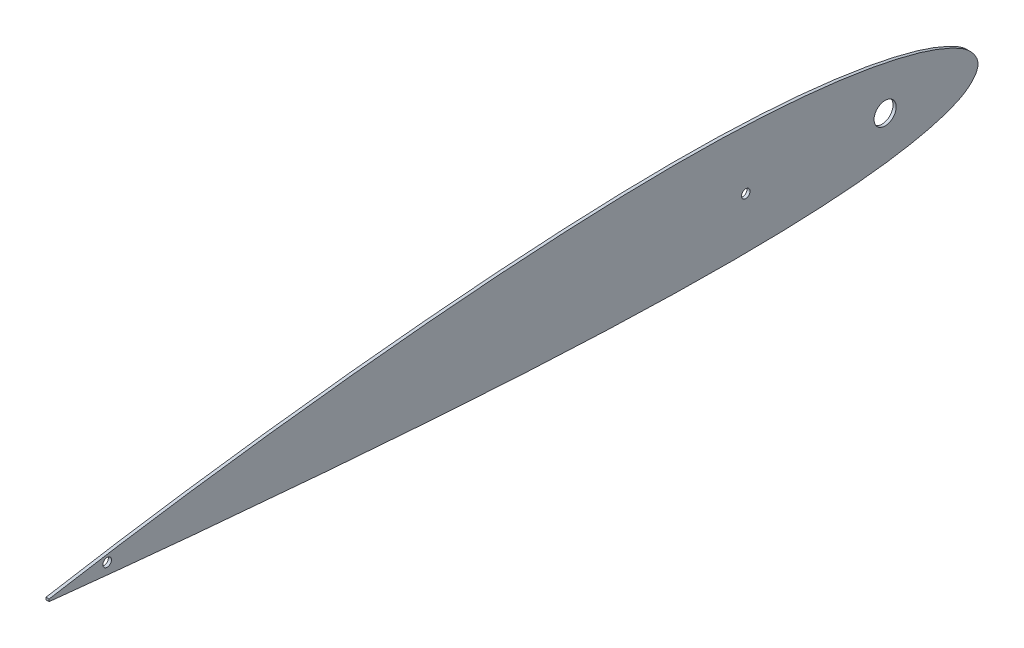
ISO-10303-21;
HEADER;
FILE_DESCRIPTION(('STEP AP214'),'2;1');
FILE_NAME('part.step','',(''),(''),'','','');
FILE_SCHEMA(('AUTOMOTIVE_DESIGN { 1 0 10303 214 1 1 1 1 }'));
ENDSEC;
DATA;
#1=APPLICATION_CONTEXT('core data for automotive mechanical design processes');
#2=APPLICATION_PROTOCOL_DEFINITION('international standard','automotive_design',2000,#1);
#3=PRODUCT_CONTEXT('',#1,'mechanical');
#4=PRODUCT('Part','Part','',(#3));
#5=PRODUCT_RELATED_PRODUCT_CATEGORY('part','',(#4));
#6=PRODUCT_DEFINITION_FORMATION('','',#4);
#7=PRODUCT_DEFINITION_CONTEXT('part definition',#1,'design');
#8=PRODUCT_DEFINITION('design','',#6,#7);
#9=PRODUCT_DEFINITION_SHAPE('','',#8);
#10=(LENGTH_UNIT() NAMED_UNIT(*) SI_UNIT(.MILLI.,.METRE.));
#11=(NAMED_UNIT(*) PLANE_ANGLE_UNIT() SI_UNIT($,.RADIAN.));
#12=(NAMED_UNIT(*) SI_UNIT($,.STERADIAN.) SOLID_ANGLE_UNIT());
#13=UNCERTAINTY_MEASURE_WITH_UNIT(LENGTH_MEASURE(1.E-05),#10,'distance_accuracy_value','');
#14=(GEOMETRIC_REPRESENTATION_CONTEXT(3) GLOBAL_UNCERTAINTY_ASSIGNED_CONTEXT((#13)) GLOBAL_UNIT_ASSIGNED_CONTEXT((#10,
#11,#12)) REPRESENTATION_CONTEXT('',''));
#15=CARTESIAN_POINT('',(0.,0.,0.));
#16=DIRECTION('',(0.,0.,1.));
#17=DIRECTION('',(1.,0.,0.));
#18=AXIS2_PLACEMENT_3D('',#15,#16,#17);
#19=CARTESIAN_POINT('',(2.,0.75598826106333,599.999530242579));
#20=CARTESIAN_POINT('',(2.,2.4524987482755,590.052379501365));
#21=CARTESIAN_POINT('',(2.,5.8459651475744,570.155466359057));
#22=CARTESIAN_POINT('',(2.,12.0847239294705,530.289585045662));
#23=CARTESIAN_POINT('',(2.,19.1802817061549,480.383336653861));
#24=CARTESIAN_POINT('',(2.,26.5512394608977,420.391788196972));
#25=CARTESIAN_POINT('',(2.,32.7918773882698,360.32824174972));
#26=CARTESIAN_POINT('',(2.,37.6773344631083,300.196799247508));
#27=CARTESIAN_POINT('',(2.,40.9804876447408,239.932139637476));
#28=CARTESIAN_POINT('',(2.,41.8113540065519,189.601999592275));
#29=CARTESIAN_POINT('',(2.,40.6777610229941,149.301309203613));
#30=CARTESIAN_POINT('',(2.,38.837323635028,119.086134444528));
#31=CARTESIAN_POINT('',(2.,35.6543986455394,88.8988457534431));
#32=CARTESIAN_POINT('',(2.,31.6230632719032,63.8210534419709));
#33=CARTESIAN_POINT('',(2.,27.0009351860937,43.857841840767));
#34=CARTESIAN_POINT('',(2.,22.5929219578554,28.8456198857225));
#35=CARTESIAN_POINT('',(2.,17.3328795516285,16.2488329264884));
#36=CARTESIAN_POINT('',(2.,11.1018529212385,5.47548354318433));
#37=CARTESIAN_POINT('',(2.,-0.556938386896296,-3.66902538864164));
#38=CARTESIAN_POINT('',(2.,-11.2122523981201,6.57738796173951));
#39=CARTESIAN_POINT('',(2.,-16.4102500810757,17.8231989539442));
#40=CARTESIAN_POINT('',(2.,-20.4900355819357,30.7456883640696));
#41=CARTESIAN_POINT('',(2.,-23.6036140834946,45.9391306005209));
#42=CARTESIAN_POINT('',(2.,-26.6237386585509,65.978309205385));
#43=CARTESIAN_POINT('',(2.,-28.9288565619858,90.9478753448551));
#44=CARTESIAN_POINT('',(2.,-30.3666338598329,120.852577651373));
#45=CARTESIAN_POINT('',(2.,-30.8747139778424,150.68178215675));
#46=CARTESIAN_POINT('',(2.,-30.6711415070658,190.405527307663));
#47=CARTESIAN_POINT('',(2.,-29.2465657539196,240.140809504373));
#48=CARTESIAN_POINT('',(2.,-26.2744417059327,299.888893463615));
#49=CARTESIAN_POINT('',(2.,-22.3071523636082,359.759776769988));
#50=CARTESIAN_POINT('',(2.,-17.6654127159852,419.693534830798));
#51=CARTESIAN_POINT('',(2.,-12.540727455109,479.711620721196));
#52=CARTESIAN_POINT('',(2.,-7.8930613936279,529.773629881439));
#53=CARTESIAN_POINT('',(2.,-3.9226473908421,569.880803461387));
#54=CARTESIAN_POINT('',(2.,-1.81241010151327,589.952317430897));
#55=CARTESIAN_POINT('',(2.,-0.75598826106333,600.000469757421));
#56=B_SPLINE_CURVE_WITH_KNOTS('',3,(#19,#20,#21,#22,#23,#24,#25,#26,#27,#28,#29,#30,#31,#32,#33,
#34,#35,#36,#37,#38,#39,#40,#41,#42,#43,#44,#45,#46,#47,#48,#49,#50,#51,#52,#53,#54,#55),
.UNSPECIFIED.,.F.,.F.,(4,1,1,1,1,1,1,1,1,1,1,1,1,1,1,1,1,1,1,1,1,1,1,1,1,1,1,1,1,1,1,1,1,1,4),
(0.,0.0247583527022921,0.0495232057983208,0.099002464419805,0.148431640988793,0.197816092678823,
0.247156978041538,0.296440500967814,0.345884085447012,0.370605915917013,0.395346156344423,
0.420138805885135,0.4450560288657,0.457622030352105,0.470360866612067,0.483523326653886,
0.490626325383128,0.501772115898221,0.512907946738326,0.519977099804335,0.533052484339323,
0.545674076898575,0.558115541146016,0.58272509680566,0.607174358189599,0.631557278595084,
0.65591625667648,0.704636043070596,0.753621853029336,0.80268738739157,0.851851697592658,
0.901113053173649,0.950481472331415,0.975210155559022,1.),.UNSPECIFIED.);
#57=DIRECTION('',(-1.,0.,0.));
#58=VECTOR('',#57,1.);
#59=SURFACE_OF_LINEAR_EXTRUSION('',#56,#58);
#60=CARTESIAN_POINT('',(0.,0.75598826106333,599.999530242579));
#61=CARTESIAN_POINT('',(0.,2.4524987482755,590.052379501365));
#62=CARTESIAN_POINT('',(0.,5.8459651475744,570.155466359057));
#63=CARTESIAN_POINT('',(0.,12.0847239294705,530.289585045662));
#64=CARTESIAN_POINT('',(0.,19.1802817061549,480.383336653861));
#65=CARTESIAN_POINT('',(0.,26.5512394608977,420.391788196972));
#66=CARTESIAN_POINT('',(0.,32.7918773882698,360.32824174972));
#67=CARTESIAN_POINT('',(0.,37.6773344631083,300.196799247508));
#68=CARTESIAN_POINT('',(0.,40.9804876447408,239.932139637476));
#69=CARTESIAN_POINT('',(0.,41.8113540065519,189.601999592275));
#70=CARTESIAN_POINT('',(0.,40.6777610229941,149.301309203613));
#71=CARTESIAN_POINT('',(0.,38.837323635028,119.086134444528));
#72=CARTESIAN_POINT('',(0.,35.6543986455394,88.8988457534431));
#73=CARTESIAN_POINT('',(0.,31.6230632719032,63.8210534419709));
#74=CARTESIAN_POINT('',(0.,27.0009351860937,43.857841840767));
#75=CARTESIAN_POINT('',(0.,22.5929219578554,28.8456198857225));
#76=CARTESIAN_POINT('',(0.,17.3328795516285,16.2488329264884));
#77=CARTESIAN_POINT('',(0.,11.1018529212385,5.47548354318433));
#78=CARTESIAN_POINT('',(0.,-0.556938386896296,-3.66902538864164));
#79=CARTESIAN_POINT('',(0.,-11.2122523981201,6.57738796173951));
#80=CARTESIAN_POINT('',(0.,-16.4102500810757,17.8231989539442));
#81=CARTESIAN_POINT('',(0.,-20.4900355819357,30.7456883640696));
#82=CARTESIAN_POINT('',(0.,-23.6036140834946,45.9391306005209));
#83=CARTESIAN_POINT('',(0.,-26.6237386585509,65.978309205385));
#84=CARTESIAN_POINT('',(0.,-28.9288565619858,90.9478753448551));
#85=CARTESIAN_POINT('',(0.,-30.3666338598329,120.852577651373));
#86=CARTESIAN_POINT('',(0.,-30.8747139778424,150.68178215675));
#87=CARTESIAN_POINT('',(0.,-30.6711415070658,190.405527307663));
#88=CARTESIAN_POINT('',(0.,-29.2465657539196,240.140809504373));
#89=CARTESIAN_POINT('',(0.,-26.2744417059327,299.888893463615));
#90=CARTESIAN_POINT('',(0.,-22.3071523636082,359.759776769988));
#91=CARTESIAN_POINT('',(0.,-17.6654127159852,419.693534830798));
#92=CARTESIAN_POINT('',(0.,-12.540727455109,479.711620721196));
#93=CARTESIAN_POINT('',(0.,-7.8930613936279,529.773629881439));
#94=CARTESIAN_POINT('',(0.,-3.9226473908421,569.880803461387));
#95=CARTESIAN_POINT('',(0.,-1.81241010151327,589.952317430897));
#96=CARTESIAN_POINT('',(0.,-0.75598826106333,600.000469757421));
#97=B_SPLINE_CURVE_WITH_KNOTS('',3,(#60,#61,#62,#63,#64,#65,#66,#67,#68,#69,#70,#71,#72,#73,#74,
#75,#76,#77,#78,#79,#80,#81,#82,#83,#84,#85,#86,#87,#88,#89,#90,#91,#92,#93,#94,#95,#96),
.UNSPECIFIED.,.F.,.F.,(4,1,1,1,1,1,1,1,1,1,1,1,1,1,1,1,1,1,1,1,1,1,1,1,1,1,1,1,1,1,1,1,1,1,4),
(0.,0.0247583527022921,0.0495232057983208,0.099002464419805,0.148431640988793,0.197816092678823,
0.247156978041538,0.296440500967814,0.345884085447012,0.370605915917013,0.395346156344423,
0.420138805885135,0.4450560288657,0.457622030352105,0.470360866612067,0.483523326653886,
0.490626325383128,0.501772115898221,0.512907946738326,0.519977099804335,0.533052484339323,
0.545674076898575,0.558115541146016,0.58272509680566,0.607174358189599,0.631557278595084,
0.65591625667648,0.704636043070596,0.753621853029336,0.80268738739157,0.851851697592658,
0.901113053173649,0.950481472331415,0.975210155559022,1.),.UNSPECIFIED.);
#98=CARTESIAN_POINT('',(0.,0.75598826106333,599.999530242579));
#99=VERTEX_POINT('',#98);
#100=CARTESIAN_POINT('',(0.,-0.755988261063331,600.000469757421));
#101=VERTEX_POINT('',#100);
#102=EDGE_CURVE('E69',#99,#101,#97,.T.);
#103=ORIENTED_EDGE('',*,*,#102,.F.);
#104=DIRECTION('',(-1.,0.,0.));
#105=VECTOR('',#104,1.);
#106=CARTESIAN_POINT('',(2.,0.75598826106333,599.999530242579));
#107=LINE('',#106,#105);
#108=CARTESIAN_POINT('',(2.,0.75598826106333,599.999530242579));
#109=VERTEX_POINT('',#108);
#110=EDGE_CURVE('E49',#109,#99,#107,.T.);
#111=ORIENTED_EDGE('',*,*,#110,.F.);
#112=CARTESIAN_POINT('',(2.,-0.755988261063331,600.000469757421));
#113=VERTEX_POINT('',#112);
#114=EDGE_CURVE('E70',#109,#113,#56,.T.);
#115=ORIENTED_EDGE('',*,*,#114,.T.);
#116=DIRECTION('',(-1.,0.,0.));
#117=VECTOR('',#116,1.);
#118=CARTESIAN_POINT('',(2.,-0.755988261063331,600.000469757421));
#119=LINE('',#118,#117);
#120=EDGE_CURVE('E11',#113,#101,#119,.T.);
#121=ORIENTED_EDGE('',*,*,#120,.T.);
#122=EDGE_LOOP('',(#103,#111,#115,#121));
#123=FACE_BOUND('',#122,.T.);
#124=ADVANCED_FACE('F39',(#123),#59,.T.);
#125=CARTESIAN_POINT('',(2.,0.75598826106333,599.999530242579));
#126=DIRECTION('',(0.,-0.000621381778982613,-0.999999806942324));
#127=DIRECTION('',(0.,-0.999999806942324,0.000621381778982613));
#128=AXIS2_PLACEMENT_3D('',#125,#126,#127);
#129=PLANE('',#128);
#130=DIRECTION('',(0.,0.999999806942324,-0.000621381778982613));
#131=VECTOR('',#130,1.);
#132=CARTESIAN_POINT('',(0.,0.75598826106333,599.999530242579));
#133=LINE('',#132,#131);
#134=EDGE_CURVE('E64',#101,#99,#133,.T.);
#135=ORIENTED_EDGE('',*,*,#134,.F.);
#136=ORIENTED_EDGE('',*,*,#120,.F.);
#137=DIRECTION('',(0.,0.999999806942324,-0.000621381778982613));
#138=VECTOR('',#137,1.);
#139=CARTESIAN_POINT('',(2.,0.75598826106333,599.999530242579));
#140=LINE('',#139,#138);
#141=EDGE_CURVE('E58',#113,#109,#140,.T.);
#142=ORIENTED_EDGE('',*,*,#141,.T.);
#143=ORIENTED_EDGE('',*,*,#110,.T.);
#144=EDGE_LOOP('',(#135,#136,#142,#143));
#145=FACE_BOUND('',#144,.T.);
#146=ADVANCED_FACE('F73',(#145),#129,.F.);
#147=CARTESIAN_POINT('',(2.,1.65489158146666,0.173047394316462));
#148=DIRECTION('',(-1.,0.,0.));
#149=DIRECTION('',(0.,0.,-1.));
#150=AXIS2_PLACEMENT_3D('',#147,#148,#149);
#151=PLANE('',#150);
#152=CARTESIAN_POINT('',(2.,2.5000018824215,60.));
#153=DIRECTION('',(-1.,0.,0.));
#154=DIRECTION('',(0.,0.,1.));
#155=AXIS2_PLACEMENT_3D('',#152,#153,#154);
#156=CIRCLE('',#155,7.13626633000001);
#157=CARTESIAN_POINT('',(2.,2.5000018824215,67.13626633));
#158=VERTEX_POINT('',#157);
#159=EDGE_CURVE('E89',#158,#158,#156,.T.);
#160=ORIENTED_EDGE('',*,*,#159,.T.);
#161=EDGE_LOOP('',(#160));
#162=FACE_BOUND('',#161,.T.);
#163=CARTESIAN_POINT('',(2.,2.5000018824215,150.));
#164=DIRECTION('',(-1.,0.,0.));
#165=DIRECTION('',(0.,0.,1.));
#166=AXIS2_PLACEMENT_3D('',#163,#164,#165);
#167=CIRCLE('',#166,2.75000000000001);
#168=CARTESIAN_POINT('',(2.,2.5000018824215,152.75));
#169=VERTEX_POINT('',#168);
#170=EDGE_CURVE('E103',#169,#169,#167,.T.);
#171=ORIENTED_EDGE('',*,*,#170,.T.);
#172=EDGE_LOOP('',(#171));
#173=FACE_BOUND('',#172,.T.);
#174=CARTESIAN_POINT('',(2.,2.50000188242148,562.498439304419));
#175=DIRECTION('',(-1.,0.,0.));
#176=DIRECTION('',(0.,0.,1.));
#177=AXIS2_PLACEMENT_3D('',#174,#175,#176);
#178=CIRCLE('',#177,2.75000000000004);
#179=CARTESIAN_POINT('',(2.,2.50000188242148,565.248439304419));
#180=VERTEX_POINT('',#179);
#181=EDGE_CURVE('E105',#180,#180,#178,.T.);
#182=ORIENTED_EDGE('',*,*,#181,.T.);
#183=EDGE_LOOP('',(#182));
#184=FACE_BOUND('',#183,.T.);
#185=ORIENTED_EDGE('',*,*,#114,.F.);
#186=ORIENTED_EDGE('',*,*,#141,.F.);
#187=EDGE_LOOP('',(#185,#186));
#188=FACE_BOUND('',#187,.T.);
#189=ADVANCED_FACE('F118',(#162,#173,#184,#188),#151,.F.);
#190=CARTESIAN_POINT('',(0.,1.65489158146666,0.173047394316462));
#191=DIRECTION('',(-1.,0.,0.));
#192=DIRECTION('',(0.,0.,-1.));
#193=AXIS2_PLACEMENT_3D('',#190,#191,#192);
#194=PLANE('',#193);
#195=CARTESIAN_POINT('',(0.,2.5000018824215,60.));
#196=DIRECTION('',(1.,0.,0.));
#197=DIRECTION('',(0.,0.,-1.));
#198=AXIS2_PLACEMENT_3D('',#195,#196,#197);
#199=CIRCLE('',#198,7.13626633000001);
#200=CARTESIAN_POINT('',(0.,2.5000018824215,67.13626633));
#201=VERTEX_POINT('',#200);
#202=EDGE_CURVE('E43',#201,#201,#199,.T.);
#203=ORIENTED_EDGE('',*,*,#202,.T.);
#204=EDGE_LOOP('',(#203));
#205=FACE_BOUND('',#204,.T.);
#206=CARTESIAN_POINT('',(0.,2.5000018824215,150.));
#207=DIRECTION('',(1.,0.,0.));
#208=DIRECTION('',(0.,0.,-1.));
#209=AXIS2_PLACEMENT_3D('',#206,#207,#208);
#210=CIRCLE('',#209,2.75000000000001);
#211=CARTESIAN_POINT('',(0.,2.5000018824215,152.75));
#212=VERTEX_POINT('',#211);
#213=EDGE_CURVE('E79',#212,#212,#210,.T.);
#214=ORIENTED_EDGE('',*,*,#213,.T.);
#215=EDGE_LOOP('',(#214));
#216=FACE_BOUND('',#215,.T.);
#217=CARTESIAN_POINT('',(0.,2.50000188242148,562.498439304419));
#218=DIRECTION('',(1.,0.,0.));
#219=DIRECTION('',(0.,0.,-1.));
#220=AXIS2_PLACEMENT_3D('',#217,#218,#219);
#221=CIRCLE('',#220,2.75000000000004);
#222=CARTESIAN_POINT('',(0.,2.50000188242148,565.248439304419));
#223=VERTEX_POINT('',#222);
#224=EDGE_CURVE('E87',#223,#223,#221,.T.);
#225=ORIENTED_EDGE('',*,*,#224,.T.);
#226=EDGE_LOOP('',(#225));
#227=FACE_BOUND('',#226,.T.);
#228=ORIENTED_EDGE('',*,*,#102,.T.);
#229=ORIENTED_EDGE('',*,*,#134,.T.);
#230=EDGE_LOOP('',(#228,#229));
#231=FACE_BOUND('',#230,.T.);
#232=ADVANCED_FACE('F67',(#205,#216,#227,#231),#194,.T.);
#233=CARTESIAN_POINT('',(-1.2E-05,2.50000188242148,562.498439304419));
#234=DIRECTION('',(1.,0.,0.));
#235=DIRECTION('',(0.,0.,1.));
#236=AXIS2_PLACEMENT_3D('',#233,#234,#235);
#237=CYLINDRICAL_SURFACE('',#236,2.75000000000004);
#238=CARTESIAN_POINT('',(0.,2.50000188242148,565.248439304419));
#239=CARTESIAN_POINT('',(0.0208333333333333,2.50000188242148,565.248439304419));
#240=CARTESIAN_POINT('',(0.0416666666666667,2.50000188242148,565.248439304419));
#241=CARTESIAN_POINT('',(0.0833333333333333,2.50000188242148,565.248439304419));
#242=CARTESIAN_POINT('',(0.104166666666667,2.50000188242148,565.248439304419));
#243=CARTESIAN_POINT('',(0.145833333333333,2.50000188242148,565.248439304419));
#244=CARTESIAN_POINT('',(0.166666666666667,2.50000188242148,565.248439304419));
#245=CARTESIAN_POINT('',(0.208333333333333,2.50000188242148,565.248439304419));
#246=CARTESIAN_POINT('',(0.229166666666667,2.50000188242148,565.248439304419));
#247=CARTESIAN_POINT('',(0.270833333333333,2.50000188242148,565.248439304419));
#248=CARTESIAN_POINT('',(0.291666666666667,2.50000188242148,565.248439304419));
#249=CARTESIAN_POINT('',(0.333333333333333,2.50000188242148,565.248439304419));
#250=CARTESIAN_POINT('',(0.354166666666667,2.50000188242148,565.248439304419));
#251=CARTESIAN_POINT('',(0.395833333333333,2.50000188242148,565.248439304419));
#252=CARTESIAN_POINT('',(0.416666666666667,2.50000188242148,565.248439304419));
#253=CARTESIAN_POINT('',(0.458333333333333,2.50000188242148,565.248439304419));
#254=CARTESIAN_POINT('',(0.479166666666667,2.50000188242148,565.248439304419));
#255=CARTESIAN_POINT('',(0.520833333333333,2.50000188242148,565.248439304419));
#256=CARTESIAN_POINT('',(0.541666666666667,2.50000188242148,565.248439304419));
#257=CARTESIAN_POINT('',(0.583333333333333,2.50000188242148,565.248439304419));
#258=CARTESIAN_POINT('',(0.604166666666667,2.50000188242148,565.248439304419));
#259=CARTESIAN_POINT('',(0.645833333333333,2.50000188242148,565.248439304419));
#260=CARTESIAN_POINT('',(0.666666666666667,2.50000188242148,565.248439304419));
#261=CARTESIAN_POINT('',(0.708333333333333,2.50000188242148,565.248439304419));
#262=CARTESIAN_POINT('',(0.729166666666667,2.50000188242148,565.248439304419));
#263=CARTESIAN_POINT('',(0.770833333333333,2.50000188242148,565.248439304419));
#264=CARTESIAN_POINT('',(0.791666666666667,2.50000188242148,565.248439304419));
#265=CARTESIAN_POINT('',(0.833333333333333,2.50000188242148,565.248439304419));
#266=CARTESIAN_POINT('',(0.854166666666667,2.50000188242148,565.248439304419));
#267=CARTESIAN_POINT('',(0.895833333333333,2.50000188242148,565.248439304419));
#268=CARTESIAN_POINT('',(0.916666666666667,2.50000188242148,565.248439304419));
#269=CARTESIAN_POINT('',(0.958333333333333,2.50000188242148,565.248439304419));
#270=CARTESIAN_POINT('',(0.979166666666667,2.50000188242148,565.248439304419));
#271=CARTESIAN_POINT('',(1.02083333333333,2.50000188242148,565.248439304419));
#272=CARTESIAN_POINT('',(1.04166666666667,2.50000188242148,565.248439304419));
#273=CARTESIAN_POINT('',(1.08333333333333,2.50000188242148,565.248439304419));
#274=CARTESIAN_POINT('',(1.10416666666667,2.50000188242148,565.248439304419));
#275=CARTESIAN_POINT('',(1.14583333333333,2.50000188242148,565.248439304419));
#276=CARTESIAN_POINT('',(1.16666666666667,2.50000188242148,565.248439304419));
#277=CARTESIAN_POINT('',(1.20833333333333,2.50000188242148,565.248439304419));
#278=CARTESIAN_POINT('',(1.22916666666667,2.50000188242148,565.248439304419));
#279=CARTESIAN_POINT('',(1.27083333333333,2.50000188242148,565.248439304419));
#280=CARTESIAN_POINT('',(1.29166666666667,2.50000188242148,565.248439304419));
#281=CARTESIAN_POINT('',(1.33333333333333,2.50000188242148,565.248439304419));
#282=CARTESIAN_POINT('',(1.35416666666667,2.50000188242148,565.248439304419));
#283=CARTESIAN_POINT('',(1.39583333333333,2.50000188242148,565.248439304419));
#284=CARTESIAN_POINT('',(1.41666666666667,2.50000188242148,565.248439304419));
#285=CARTESIAN_POINT('',(1.45833333333333,2.50000188242148,565.248439304419));
#286=CARTESIAN_POINT('',(1.47916666666667,2.50000188242148,565.248439304419));
#287=CARTESIAN_POINT('',(1.52083333333333,2.50000188242148,565.248439304419));
#288=CARTESIAN_POINT('',(1.54166666666667,2.50000188242148,565.248439304419));
#289=CARTESIAN_POINT('',(1.58333333333333,2.50000188242148,565.248439304419));
#290=CARTESIAN_POINT('',(1.60416666666667,2.50000188242148,565.248439304419));
#291=CARTESIAN_POINT('',(1.64583333333333,2.50000188242148,565.248439304419));
#292=CARTESIAN_POINT('',(1.66666666666667,2.50000188242148,565.248439304419));
#293=CARTESIAN_POINT('',(1.70833333333333,2.50000188242148,565.248439304419));
#294=CARTESIAN_POINT('',(1.72916666666667,2.50000188242148,565.248439304419));
#295=CARTESIAN_POINT('',(1.77083333333333,2.50000188242148,565.248439304419));
#296=CARTESIAN_POINT('',(1.79166666666667,2.50000188242148,565.248439304419));
#297=CARTESIAN_POINT('',(1.83333333333333,2.50000188242148,565.248439304419));
#298=CARTESIAN_POINT('',(1.85416666666667,2.50000188242148,565.248439304419));
#299=CARTESIAN_POINT('',(1.89583333333333,2.50000188242148,565.248439304419));
#300=CARTESIAN_POINT('',(1.91666666666667,2.50000188242148,565.248439304419));
#301=CARTESIAN_POINT('',(1.95833333333333,2.50000188242148,565.248439304419));
#302=CARTESIAN_POINT('',(1.97916666666667,2.50000188242148,565.248439304419));
#303=CARTESIAN_POINT('',(2.,2.50000188242148,565.248439304419));
#304=B_SPLINE_CURVE_WITH_KNOTS('',3,(#238,#239,#240,#241,#242,#243,#244,#245,#246,#247,#248,
#249,#250,#251,#252,#253,#254,#255,#256,#257,#258,#259,#260,#261,#262,#263,#264,#265,#266,#267,
#268,#269,#270,#271,#272,#273,#274,#275,#276,#277,#278,#279,#280,#281,#282,#283,#284,#285,#286,
#287,#288,#289,#290,#291,#292,#293,#294,#295,#296,#297,#298,#299,#300,#301,#302,#303),
.UNSPECIFIED.,.F.,.F.,(4,2,2,2,2,2,2,2,2,2,2,2,2,2,2,2,2,2,2,2,2,2,2,2,2,2,2,2,2,2,2,2,4),(0.,
0.0625,0.125,0.1875,0.25,0.3125,0.375,0.4375,0.5,0.5625,0.625,0.6875,0.75,0.8125,0.875,0.9375,
1.,1.0625,1.125,1.1875,1.25,1.3125,1.375,1.4375,1.5,1.5625,1.625,1.6875,1.75,1.8125,1.875,
1.9375,2.),.UNSPECIFIED.);
#305=EDGE_CURVE('BSEAM99',#223,#180,#304,.T.);
#306=ORIENTED_EDGE('',*,*,#224,.F.);
#307=ORIENTED_EDGE('',*,*,#181,.F.);
#308=ORIENTED_EDGE('',*,*,#305,.T.);
#309=ORIENTED_EDGE('',*,*,#305,.F.);
#310=EDGE_LOOP('',(#306,#308,#307,#309));
#311=FACE_BOUND('',#310,.T.);
#312=ADVANCED_FACE('F99',(#311),#237,.F.);
#313=CARTESIAN_POINT('',(-1.2E-05,2.5000018824215,150.));
#314=DIRECTION('',(1.,0.,0.));
#315=DIRECTION('',(0.,0.,1.));
#316=AXIS2_PLACEMENT_3D('',#313,#314,#315);
#317=CYLINDRICAL_SURFACE('',#316,2.75000000000001);
#318=CARTESIAN_POINT('',(0.,2.5000018824215,152.75));
#319=CARTESIAN_POINT('',(0.0208333333333333,2.5000018824215,152.75));
#320=CARTESIAN_POINT('',(0.0416666666666667,2.5000018824215,152.75));
#321=CARTESIAN_POINT('',(0.0833333333333333,2.5000018824215,152.75));
#322=CARTESIAN_POINT('',(0.104166666666667,2.5000018824215,152.75));
#323=CARTESIAN_POINT('',(0.145833333333333,2.5000018824215,152.75));
#324=CARTESIAN_POINT('',(0.166666666666667,2.5000018824215,152.75));
#325=CARTESIAN_POINT('',(0.208333333333333,2.5000018824215,152.75));
#326=CARTESIAN_POINT('',(0.229166666666667,2.5000018824215,152.75));
#327=CARTESIAN_POINT('',(0.270833333333333,2.5000018824215,152.75));
#328=CARTESIAN_POINT('',(0.291666666666667,2.5000018824215,152.75));
#329=CARTESIAN_POINT('',(0.333333333333333,2.5000018824215,152.75));
#330=CARTESIAN_POINT('',(0.354166666666667,2.5000018824215,152.75));
#331=CARTESIAN_POINT('',(0.395833333333333,2.5000018824215,152.75));
#332=CARTESIAN_POINT('',(0.416666666666667,2.5000018824215,152.75));
#333=CARTESIAN_POINT('',(0.458333333333333,2.5000018824215,152.75));
#334=CARTESIAN_POINT('',(0.479166666666667,2.5000018824215,152.75));
#335=CARTESIAN_POINT('',(0.520833333333333,2.5000018824215,152.75));
#336=CARTESIAN_POINT('',(0.541666666666667,2.5000018824215,152.75));
#337=CARTESIAN_POINT('',(0.583333333333333,2.5000018824215,152.75));
#338=CARTESIAN_POINT('',(0.604166666666667,2.5000018824215,152.75));
#339=CARTESIAN_POINT('',(0.645833333333333,2.5000018824215,152.75));
#340=CARTESIAN_POINT('',(0.666666666666667,2.5000018824215,152.75));
#341=CARTESIAN_POINT('',(0.708333333333333,2.5000018824215,152.75));
#342=CARTESIAN_POINT('',(0.729166666666667,2.5000018824215,152.75));
#343=CARTESIAN_POINT('',(0.770833333333333,2.5000018824215,152.75));
#344=CARTESIAN_POINT('',(0.791666666666667,2.5000018824215,152.75));
#345=CARTESIAN_POINT('',(0.833333333333333,2.5000018824215,152.75));
#346=CARTESIAN_POINT('',(0.854166666666667,2.5000018824215,152.75));
#347=CARTESIAN_POINT('',(0.895833333333333,2.5000018824215,152.75));
#348=CARTESIAN_POINT('',(0.916666666666667,2.5000018824215,152.75));
#349=CARTESIAN_POINT('',(0.958333333333333,2.5000018824215,152.75));
#350=CARTESIAN_POINT('',(0.979166666666667,2.5000018824215,152.75));
#351=CARTESIAN_POINT('',(1.02083333333333,2.5000018824215,152.75));
#352=CARTESIAN_POINT('',(1.04166666666667,2.5000018824215,152.75));
#353=CARTESIAN_POINT('',(1.08333333333333,2.5000018824215,152.75));
#354=CARTESIAN_POINT('',(1.10416666666667,2.5000018824215,152.75));
#355=CARTESIAN_POINT('',(1.14583333333333,2.5000018824215,152.75));
#356=CARTESIAN_POINT('',(1.16666666666667,2.5000018824215,152.75));
#357=CARTESIAN_POINT('',(1.20833333333333,2.5000018824215,152.75));
#358=CARTESIAN_POINT('',(1.22916666666667,2.5000018824215,152.75));
#359=CARTESIAN_POINT('',(1.27083333333333,2.5000018824215,152.75));
#360=CARTESIAN_POINT('',(1.29166666666667,2.5000018824215,152.75));
#361=CARTESIAN_POINT('',(1.33333333333333,2.5000018824215,152.75));
#362=CARTESIAN_POINT('',(1.35416666666667,2.5000018824215,152.75));
#363=CARTESIAN_POINT('',(1.39583333333333,2.5000018824215,152.75));
#364=CARTESIAN_POINT('',(1.41666666666667,2.5000018824215,152.75));
#365=CARTESIAN_POINT('',(1.45833333333333,2.5000018824215,152.75));
#366=CARTESIAN_POINT('',(1.47916666666667,2.5000018824215,152.75));
#367=CARTESIAN_POINT('',(1.52083333333333,2.5000018824215,152.75));
#368=CARTESIAN_POINT('',(1.54166666666667,2.5000018824215,152.75));
#369=CARTESIAN_POINT('',(1.58333333333333,2.5000018824215,152.75));
#370=CARTESIAN_POINT('',(1.60416666666667,2.5000018824215,152.75));
#371=CARTESIAN_POINT('',(1.64583333333333,2.5000018824215,152.75));
#372=CARTESIAN_POINT('',(1.66666666666667,2.5000018824215,152.75));
#373=CARTESIAN_POINT('',(1.70833333333333,2.5000018824215,152.75));
#374=CARTESIAN_POINT('',(1.72916666666667,2.5000018824215,152.75));
#375=CARTESIAN_POINT('',(1.77083333333333,2.5000018824215,152.75));
#376=CARTESIAN_POINT('',(1.79166666666667,2.5000018824215,152.75));
#377=CARTESIAN_POINT('',(1.83333333333333,2.5000018824215,152.75));
#378=CARTESIAN_POINT('',(1.85416666666667,2.5000018824215,152.75));
#379=CARTESIAN_POINT('',(1.89583333333333,2.5000018824215,152.75));
#380=CARTESIAN_POINT('',(1.91666666666667,2.5000018824215,152.75));
#381=CARTESIAN_POINT('',(1.95833333333333,2.5000018824215,152.75));
#382=CARTESIAN_POINT('',(1.97916666666667,2.5000018824215,152.75));
#383=CARTESIAN_POINT('',(2.,2.5000018824215,152.75));
#384=B_SPLINE_CURVE_WITH_KNOTS('',3,(#318,#319,#320,#321,#322,#323,#324,#325,#326,#327,#328,
#329,#330,#331,#332,#333,#334,#335,#336,#337,#338,#339,#340,#341,#342,#343,#344,#345,#346,#347,
#348,#349,#350,#351,#352,#353,#354,#355,#356,#357,#358,#359,#360,#361,#362,#363,#364,#365,#366,
#367,#368,#369,#370,#371,#372,#373,#374,#375,#376,#377,#378,#379,#380,#381,#382,#383),
.UNSPECIFIED.,.F.,.F.,(4,2,2,2,2,2,2,2,2,2,2,2,2,2,2,2,2,2,2,2,2,2,2,2,2,2,2,2,2,2,2,2,4),(0.,
0.0625,0.125,0.1875,0.25,0.3125,0.375,0.4375,0.5,0.5625,0.625,0.6875,0.75,0.8125,0.875,0.9375,
1.,1.0625,1.125,1.1875,1.25,1.3125,1.375,1.4375,1.5,1.5625,1.625,1.6875,1.75,1.8125,1.875,
1.9375,2.),.UNSPECIFIED.);
#385=EDGE_CURVE('BSEAM95',#212,#169,#384,.T.);
#386=ORIENTED_EDGE('',*,*,#213,.F.);
#387=ORIENTED_EDGE('',*,*,#170,.F.);
#388=ORIENTED_EDGE('',*,*,#385,.T.);
#389=ORIENTED_EDGE('',*,*,#385,.F.);
#390=EDGE_LOOP('',(#386,#388,#387,#389));
#391=FACE_BOUND('',#390,.T.);
#392=ADVANCED_FACE('F95',(#391),#317,.F.);
#393=CARTESIAN_POINT('',(-1.2E-05,2.5000018824215,60.));
#394=DIRECTION('',(1.,0.,0.));
#395=DIRECTION('',(0.,0.,1.));
#396=AXIS2_PLACEMENT_3D('',#393,#394,#395);
#397=CYLINDRICAL_SURFACE('',#396,7.13626633000001);
#398=CARTESIAN_POINT('',(0.,2.5000018824215,67.13626633));
#399=CARTESIAN_POINT('',(0.0208333333333333,2.5000018824215,67.13626633));
#400=CARTESIAN_POINT('',(0.0416666666666667,2.5000018824215,67.13626633));
#401=CARTESIAN_POINT('',(0.0833333333333333,2.5000018824215,67.13626633));
#402=CARTESIAN_POINT('',(0.104166666666667,2.5000018824215,67.13626633));
#403=CARTESIAN_POINT('',(0.145833333333333,2.5000018824215,67.13626633));
#404=CARTESIAN_POINT('',(0.166666666666667,2.5000018824215,67.13626633));
#405=CARTESIAN_POINT('',(0.208333333333333,2.5000018824215,67.13626633));
#406=CARTESIAN_POINT('',(0.229166666666667,2.5000018824215,67.13626633));
#407=CARTESIAN_POINT('',(0.270833333333333,2.5000018824215,67.13626633));
#408=CARTESIAN_POINT('',(0.291666666666667,2.5000018824215,67.13626633));
#409=CARTESIAN_POINT('',(0.333333333333333,2.5000018824215,67.13626633));
#410=CARTESIAN_POINT('',(0.354166666666667,2.5000018824215,67.13626633));
#411=CARTESIAN_POINT('',(0.395833333333333,2.5000018824215,67.13626633));
#412=CARTESIAN_POINT('',(0.416666666666667,2.5000018824215,67.13626633));
#413=CARTESIAN_POINT('',(0.458333333333333,2.5000018824215,67.13626633));
#414=CARTESIAN_POINT('',(0.479166666666667,2.5000018824215,67.13626633));
#415=CARTESIAN_POINT('',(0.520833333333333,2.5000018824215,67.13626633));
#416=CARTESIAN_POINT('',(0.541666666666667,2.5000018824215,67.13626633));
#417=CARTESIAN_POINT('',(0.583333333333333,2.5000018824215,67.13626633));
#418=CARTESIAN_POINT('',(0.604166666666667,2.5000018824215,67.13626633));
#419=CARTESIAN_POINT('',(0.645833333333333,2.5000018824215,67.13626633));
#420=CARTESIAN_POINT('',(0.666666666666667,2.5000018824215,67.13626633));
#421=CARTESIAN_POINT('',(0.708333333333333,2.5000018824215,67.13626633));
#422=CARTESIAN_POINT('',(0.729166666666667,2.5000018824215,67.13626633));
#423=CARTESIAN_POINT('',(0.770833333333333,2.5000018824215,67.13626633));
#424=CARTESIAN_POINT('',(0.791666666666667,2.5000018824215,67.13626633));
#425=CARTESIAN_POINT('',(0.833333333333333,2.5000018824215,67.13626633));
#426=CARTESIAN_POINT('',(0.854166666666667,2.5000018824215,67.13626633));
#427=CARTESIAN_POINT('',(0.895833333333333,2.5000018824215,67.13626633));
#428=CARTESIAN_POINT('',(0.916666666666667,2.5000018824215,67.13626633));
#429=CARTESIAN_POINT('',(0.958333333333333,2.5000018824215,67.13626633));
#430=CARTESIAN_POINT('',(0.979166666666667,2.5000018824215,67.13626633));
#431=CARTESIAN_POINT('',(1.02083333333333,2.5000018824215,67.13626633));
#432=CARTESIAN_POINT('',(1.04166666666667,2.5000018824215,67.13626633));
#433=CARTESIAN_POINT('',(1.08333333333333,2.5000018824215,67.13626633));
#434=CARTESIAN_POINT('',(1.10416666666667,2.5000018824215,67.13626633));
#435=CARTESIAN_POINT('',(1.14583333333333,2.5000018824215,67.13626633));
#436=CARTESIAN_POINT('',(1.16666666666667,2.5000018824215,67.13626633));
#437=CARTESIAN_POINT('',(1.20833333333333,2.5000018824215,67.13626633));
#438=CARTESIAN_POINT('',(1.22916666666667,2.5000018824215,67.13626633));
#439=CARTESIAN_POINT('',(1.27083333333333,2.5000018824215,67.13626633));
#440=CARTESIAN_POINT('',(1.29166666666667,2.5000018824215,67.13626633));
#441=CARTESIAN_POINT('',(1.33333333333333,2.5000018824215,67.13626633));
#442=CARTESIAN_POINT('',(1.35416666666667,2.5000018824215,67.13626633));
#443=CARTESIAN_POINT('',(1.39583333333333,2.5000018824215,67.13626633));
#444=CARTESIAN_POINT('',(1.41666666666667,2.5000018824215,67.13626633));
#445=CARTESIAN_POINT('',(1.45833333333333,2.5000018824215,67.13626633));
#446=CARTESIAN_POINT('',(1.47916666666667,2.5000018824215,67.13626633));
#447=CARTESIAN_POINT('',(1.52083333333333,2.5000018824215,67.13626633));
#448=CARTESIAN_POINT('',(1.54166666666667,2.5000018824215,67.13626633));
#449=CARTESIAN_POINT('',(1.58333333333333,2.5000018824215,67.13626633));
#450=CARTESIAN_POINT('',(1.60416666666667,2.5000018824215,67.13626633));
#451=CARTESIAN_POINT('',(1.64583333333333,2.5000018824215,67.13626633));
#452=CARTESIAN_POINT('',(1.66666666666667,2.5000018824215,67.13626633));
#453=CARTESIAN_POINT('',(1.70833333333333,2.5000018824215,67.13626633));
#454=CARTESIAN_POINT('',(1.72916666666667,2.5000018824215,67.13626633));
#455=CARTESIAN_POINT('',(1.77083333333333,2.5000018824215,67.13626633));
#456=CARTESIAN_POINT('',(1.79166666666667,2.5000018824215,67.13626633));
#457=CARTESIAN_POINT('',(1.83333333333333,2.5000018824215,67.13626633));
#458=CARTESIAN_POINT('',(1.85416666666667,2.5000018824215,67.13626633));
#459=CARTESIAN_POINT('',(1.89583333333333,2.5000018824215,67.13626633));
#460=CARTESIAN_POINT('',(1.91666666666667,2.5000018824215,67.13626633));
#461=CARTESIAN_POINT('',(1.95833333333333,2.5000018824215,67.13626633));
#462=CARTESIAN_POINT('',(1.97916666666667,2.5000018824215,67.13626633));
#463=CARTESIAN_POINT('',(2.,2.5000018824215,67.13626633));
#464=B_SPLINE_CURVE_WITH_KNOTS('',3,(#398,#399,#400,#401,#402,#403,#404,#405,#406,#407,#408,
#409,#410,#411,#412,#413,#414,#415,#416,#417,#418,#419,#420,#421,#422,#423,#424,#425,#426,#427,
#428,#429,#430,#431,#432,#433,#434,#435,#436,#437,#438,#439,#440,#441,#442,#443,#444,#445,#446,
#447,#448,#449,#450,#451,#452,#453,#454,#455,#456,#457,#458,#459,#460,#461,#462,#463),
.UNSPECIFIED.,.F.,.F.,(4,2,2,2,2,2,2,2,2,2,2,2,2,2,2,2,2,2,2,2,2,2,2,2,2,2,2,2,2,2,2,2,4),(0.,
0.0625,0.125,0.1875,0.25,0.3125,0.375,0.4375,0.5,0.5625,0.625,0.6875,0.75,0.8125,0.875,0.9375,
1.,1.0625,1.125,1.1875,1.25,1.3125,1.375,1.4375,1.5,1.5625,1.625,1.6875,1.75,1.8125,1.875,
1.9375,2.),.UNSPECIFIED.);
#465=EDGE_CURVE('BSEAM98',#201,#158,#464,.T.);
#466=ORIENTED_EDGE('',*,*,#202,.F.);
#467=ORIENTED_EDGE('',*,*,#159,.F.);
#468=ORIENTED_EDGE('',*,*,#465,.T.);
#469=ORIENTED_EDGE('',*,*,#465,.F.);
#470=EDGE_LOOP('',(#466,#468,#467,#469));
#471=FACE_BOUND('',#470,.T.);
#472=ADVANCED_FACE('F98',(#471),#397,.F.);
#473=CLOSED_SHELL('',(#124,#146,#189,#232,#312,#392,#472));
#474=MANIFOLD_SOLID_BREP('B2',#473);
#475=ADVANCED_BREP_SHAPE_REPRESENTATION('',(#18,#474),#14);
#476=SHAPE_DEFINITION_REPRESENTATION(#9,#475);
ENDSEC;
END-ISO-10303-21;
